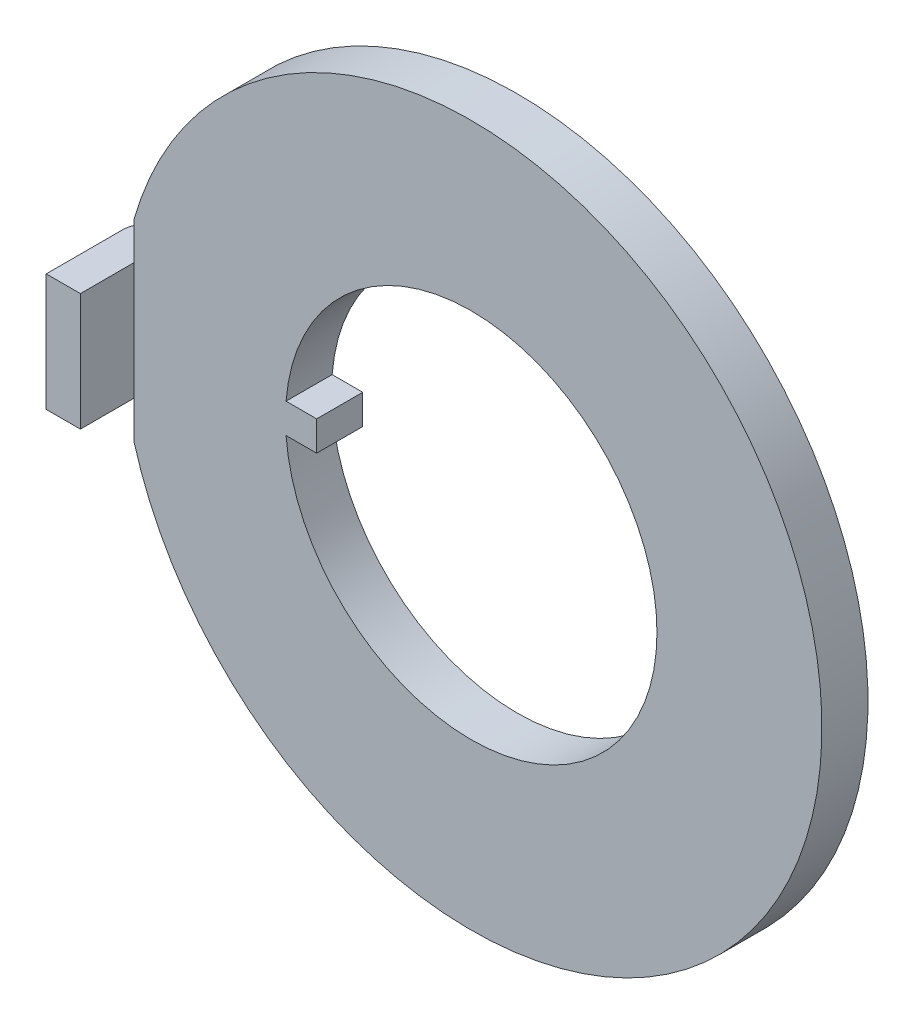
ISO-10303-21;
HEADER;
FILE_DESCRIPTION(('STEP AP214'),'2;1');
FILE_NAME('part.step','',(''),(''),'','','');
FILE_SCHEMA(('AUTOMOTIVE_DESIGN { 1 0 10303 214 1 1 1 1 }'));
ENDSEC;
DATA;
#1=APPLICATION_CONTEXT('core data for automotive mechanical design processes');
#2=APPLICATION_PROTOCOL_DEFINITION('international standard','automotive_design',2000,#1);
#3=PRODUCT_CONTEXT('',#1,'mechanical');
#4=PRODUCT('Part','Part','',(#3));
#5=PRODUCT_RELATED_PRODUCT_CATEGORY('part','',(#4));
#6=PRODUCT_DEFINITION_FORMATION('','',#4);
#7=PRODUCT_DEFINITION_CONTEXT('part definition',#1,'design');
#8=PRODUCT_DEFINITION('design','',#6,#7);
#9=PRODUCT_DEFINITION_SHAPE('','',#8);
#10=(LENGTH_UNIT() NAMED_UNIT(*) SI_UNIT(.MILLI.,.METRE.));
#11=(NAMED_UNIT(*) PLANE_ANGLE_UNIT() SI_UNIT($,.RADIAN.));
#12=(NAMED_UNIT(*) SI_UNIT($,.STERADIAN.) SOLID_ANGLE_UNIT());
#13=UNCERTAINTY_MEASURE_WITH_UNIT(LENGTH_MEASURE(1.E-05),#10,'distance_accuracy_value','');
#14=(GEOMETRIC_REPRESENTATION_CONTEXT(3) GLOBAL_UNCERTAINTY_ASSIGNED_CONTEXT((#13)) GLOBAL_UNIT_ASSIGNED_CONTEXT((#10,
#11,#12)) REPRESENTATION_CONTEXT('',''));
#15=CARTESIAN_POINT('',(0.,0.,0.));
#16=DIRECTION('',(0.,0.,1.));
#17=DIRECTION('',(1.,0.,0.));
#18=AXIS2_PLACEMENT_3D('',#15,#16,#17);
#19=CARTESIAN_POINT('',(-6.35,1.0033,1.7018));
#20=DIRECTION('',(0.,0.,-1.));
#21=DIRECTION('',(-1.,0.,0.));
#22=AXIS2_PLACEMENT_3D('',#19,#20,#21);
#23=PLANE('',#22);
#24=DIRECTION('',(0.,1.,0.));
#25=VECTOR('',#24,1.);
#26=CARTESIAN_POINT('',(-5.7658,1.0033,1.7018));
#27=LINE('',#26,#25);
#28=CARTESIAN_POINT('',(-5.7658,-1.0033,1.7018));
#29=VERTEX_POINT('',#28);
#30=CARTESIAN_POINT('',(-5.7658,1.0033,1.7018));
#31=VERTEX_POINT('',#30);
#32=EDGE_CURVE('E97',#29,#31,#27,.T.);
#33=ORIENTED_EDGE('',*,*,#32,.T.);
#34=DIRECTION('',(1.,0.,0.));
#35=VECTOR('',#34,1.);
#36=CARTESIAN_POINT('',(-5.9563,1.0033,1.7018));
#37=LINE('',#36,#35);
#38=CARTESIAN_POINT('',(-6.35,1.0033,1.7018));
#39=VERTEX_POINT('',#38);
#40=EDGE_CURVE('E85',#39,#31,#37,.T.);
#41=ORIENTED_EDGE('',*,*,#40,.F.);
#42=DIRECTION('',(0.,1.,0.));
#43=VECTOR('',#42,1.);
#44=CARTESIAN_POINT('',(-6.35,1.0033,1.7018));
#45=LINE('',#44,#43);
#46=CARTESIAN_POINT('',(-6.35,-1.0033,1.7018));
#47=VERTEX_POINT('',#46);
#48=EDGE_CURVE('E100',#39,#47,#45,.F.);
#49=ORIENTED_EDGE('',*,*,#48,.T.);
#50=DIRECTION('',(-1.,0.,0.));
#51=VECTOR('',#50,1.);
#52=CARTESIAN_POINT('',(-6.35,-1.0033,1.7018));
#53=LINE('',#52,#51);
#54=EDGE_CURVE('E95',#29,#47,#53,.T.);
#55=ORIENTED_EDGE('',*,*,#54,.F.);
#56=EDGE_LOOP('',(#33,#41,#49,#55));
#57=FACE_BOUND('',#56,.T.);
#58=ADVANCED_FACE('F17',(#57),#23,.F.);
#59=CARTESIAN_POINT('',(-5.7658,1.0033,1.7018));
#60=DIRECTION('',(-1.,0.,0.));
#61=DIRECTION('',(0.,0.,1.));
#62=AXIS2_PLACEMENT_3D('',#59,#60,#61);
#63=PLANE('',#62);
#64=DIRECTION('',(0.,1.,0.));
#65=VECTOR('',#64,1.);
#66=CARTESIAN_POINT('',(-5.7658,0.,0.7874));
#67=LINE('',#66,#65);
#68=CARTESIAN_POINT('',(-5.7658,1.0033,0.7874));
#69=VERTEX_POINT('',#68);
#70=CARTESIAN_POINT('',(-5.7658,-1.0033,0.7874));
#71=VERTEX_POINT('',#70);
#72=EDGE_CURVE('E120',#69,#71,#67,.F.);
#73=ORIENTED_EDGE('',*,*,#72,.F.);
#74=DIRECTION('',(0.,0.,1.));
#75=VECTOR('',#74,1.);
#76=CARTESIAN_POINT('',(-5.7658,1.0033,0.3937));
#77=LINE('',#76,#75);
#78=EDGE_CURVE('E111',#31,#69,#77,.F.);
#79=ORIENTED_EDGE('',*,*,#78,.F.);
#80=ORIENTED_EDGE('',*,*,#32,.F.);
#81=DIRECTION('',(0.,0.,1.));
#82=VECTOR('',#81,1.);
#83=CARTESIAN_POINT('',(-5.7658,-1.0033,0.3937));
#84=LINE('',#83,#82);
#85=EDGE_CURVE('E109',#29,#71,#84,.F.);
#86=ORIENTED_EDGE('',*,*,#85,.T.);
#87=EDGE_LOOP('',(#73,#79,#80,#86));
#88=FACE_BOUND('',#87,.T.);
#89=ADVANCED_FACE('F108',(#88),#63,.F.);
#90=CARTESIAN_POINT('',(-5.9563,1.0033,0.3937));
#91=DIRECTION('',(0.,1.,0.));
#92=DIRECTION('',(0.,0.,1.));
#93=AXIS2_PLACEMENT_3D('',#90,#91,#92);
#94=PLANE('',#93);
#95=ORIENTED_EDGE('',*,*,#40,.T.);
#96=ORIENTED_EDGE('',*,*,#78,.T.);
#97=DIRECTION('',(0.,0.,-1.));
#98=VECTOR('',#97,1.);
#99=CARTESIAN_POINT('',(-5.7658,1.0033,0.7874));
#100=LINE('',#99,#98);
#101=CARTESIAN_POINT('',(-5.7658,1.0033,0.));
#102=VERTEX_POINT('',#101);
#103=EDGE_CURVE('E158',#69,#102,#100,.T.);
#104=ORIENTED_EDGE('',*,*,#103,.T.);
#105=DIRECTION('',(1.,0.,0.));
#106=VECTOR('',#105,1.);
#107=CARTESIAN_POINT('',(-5.9563,1.0033,0.));
#108=LINE('',#107,#106);
#109=CARTESIAN_POINT('',(-5.9563,1.0033,0.));
#110=VERTEX_POINT('',#109);
#111=EDGE_CURVE('E77',#102,#110,#108,.F.);
#112=ORIENTED_EDGE('',*,*,#111,.T.);
#113=CARTESIAN_POINT('',(-5.9563,1.0033,0.3937));
#114=DIRECTION('',(0.,1.,0.));
#115=DIRECTION('',(0.,0.,1.));
#116=AXIS2_PLACEMENT_3D('',#113,#114,#115);
#117=CIRCLE('',#116,0.3937);
#118=CARTESIAN_POINT('',(-6.35,1.0033,0.3937));
#119=VERTEX_POINT('',#118);
#120=EDGE_CURVE('E20',#110,#119,#117,.T.);
#121=ORIENTED_EDGE('',*,*,#120,.T.);
#122=DIRECTION('',(0.,0.,-1.));
#123=VECTOR('',#122,1.);
#124=CARTESIAN_POINT('',(-6.35,1.0033,0.3937));
#125=LINE('',#124,#123);
#126=EDGE_CURVE('E152',#119,#39,#125,.F.);
#127=ORIENTED_EDGE('',*,*,#126,.T.);
#128=EDGE_LOOP('',(#95,#96,#104,#112,#121,#127));
#129=FACE_BOUND('',#128,.T.);
#130=ADVANCED_FACE('F275',(#129),#94,.T.);
#131=CARTESIAN_POINT('',(-6.35,1.0033,0.3937));
#132=DIRECTION('',(1.,0.,0.));
#133=DIRECTION('',(0.,0.,-1.));
#134=AXIS2_PLACEMENT_3D('',#131,#132,#133);
#135=PLANE('',#134);
#136=ORIENTED_EDGE('',*,*,#48,.F.);
#137=ORIENTED_EDGE('',*,*,#126,.F.);
#138=DIRECTION('',(0.,1.,0.));
#139=VECTOR('',#138,1.);
#140=CARTESIAN_POINT('',(-6.35,1.0033,0.3937));
#141=LINE('',#140,#139);
#142=CARTESIAN_POINT('',(-6.35,-1.0033,0.3937));
#143=VERTEX_POINT('',#142);
#144=EDGE_CURVE('E132',#143,#119,#141,.T.);
#145=ORIENTED_EDGE('',*,*,#144,.F.);
#146=DIRECTION('',(0.,0.,1.));
#147=VECTOR('',#146,1.);
#148=CARTESIAN_POINT('',(-6.35,-1.0033,0.3937));
#149=LINE('',#148,#147);
#150=EDGE_CURVE('E118',#143,#47,#149,.T.);
#151=ORIENTED_EDGE('',*,*,#150,.T.);
#152=EDGE_LOOP('',(#136,#137,#145,#151));
#153=FACE_BOUND('',#152,.T.);
#154=ADVANCED_FACE('F293',(#153),#135,.F.);
#155=CARTESIAN_POINT('',(-5.9563,-1.0033,0.3937));
#156=DIRECTION('',(0.,1.,0.));
#157=DIRECTION('',(0.,0.,1.));
#158=AXIS2_PLACEMENT_3D('',#155,#156,#157);
#159=PLANE('',#158);
#160=DIRECTION('',(0.,0.,-1.));
#161=VECTOR('',#160,1.);
#162=CARTESIAN_POINT('',(-5.7658,-1.0033,0.7874));
#163=LINE('',#162,#161);
#164=CARTESIAN_POINT('',(-5.7658,-1.0033,0.));
#165=VERTEX_POINT('',#164);
#166=EDGE_CURVE('E116',#165,#71,#163,.F.);
#167=ORIENTED_EDGE('',*,*,#166,.T.);
#168=ORIENTED_EDGE('',*,*,#85,.F.);
#169=ORIENTED_EDGE('',*,*,#54,.T.);
#170=ORIENTED_EDGE('',*,*,#150,.F.);
#171=CARTESIAN_POINT('',(-5.9563,-1.0033,0.3937));
#172=DIRECTION('',(0.,1.,0.));
#173=DIRECTION('',(0.,0.,1.));
#174=AXIS2_PLACEMENT_3D('',#171,#172,#173);
#175=CIRCLE('',#174,0.3937);
#176=CARTESIAN_POINT('',(-5.9563,-1.0033,0.));
#177=VERTEX_POINT('',#176);
#178=EDGE_CURVE('E147',#177,#143,#175,.T.);
#179=ORIENTED_EDGE('',*,*,#178,.F.);
#180=DIRECTION('',(1.,0.,0.));
#181=VECTOR('',#180,1.);
#182=CARTESIAN_POINT('',(-5.9563,-1.0033,0.));
#183=LINE('',#182,#181);
#184=EDGE_CURVE('E117',#165,#177,#183,.F.);
#185=ORIENTED_EDGE('',*,*,#184,.F.);
#186=EDGE_LOOP('',(#167,#168,#169,#170,#179,#185));
#187=FACE_BOUND('',#186,.T.);
#188=ADVANCED_FACE('F113',(#187),#159,.F.);
#189=CARTESIAN_POINT('',(0.,0.,0.7874));
#190=DIRECTION('',(0.,0.,1.));
#191=DIRECTION('',(1.,0.,0.));
#192=AXIS2_PLACEMENT_3D('',#189,#190,#191);
#193=PLANE('',#192);
#194=DIRECTION('',(1.,0.,0.));
#195=VECTOR('',#194,1.);
#196=CARTESIAN_POINT('',(-3.16482369177178,0.254,0.7874));
#197=LINE('',#196,#195);
#198=CARTESIAN_POINT('',(-3.16482369177179,0.253999999999997,0.7874));
#199=VERTEX_POINT('',#198);
#200=CARTESIAN_POINT('',(-2.6416,0.254,0.7874));
#201=VERTEX_POINT('',#200);
#202=EDGE_CURVE('E204',#199,#201,#197,.T.);
#203=ORIENTED_EDGE('',*,*,#202,.F.);
#204=CARTESIAN_POINT('',(0.,0.,0.7874));
#205=DIRECTION('',(0.,0.,1.));
#206=DIRECTION('',(1.,0.,0.));
#207=AXIS2_PLACEMENT_3D('',#204,#205,#206);
#208=CIRCLE('',#207,3.175);
#209=CARTESIAN_POINT('',(-3.16482369177179,-0.253999999999999,0.7874));
#210=VERTEX_POINT('',#209);
#211=EDGE_CURVE('E181',#199,#210,#208,.F.);
#212=ORIENTED_EDGE('',*,*,#211,.T.);
#213=DIRECTION('',(1.,0.,0.));
#214=VECTOR('',#213,1.);
#215=CARTESIAN_POINT('',(0.,-0.253999999999999,0.7874));
#216=LINE('',#215,#214);
#217=CARTESIAN_POINT('',(-2.6416,-0.254,0.7874));
#218=VERTEX_POINT('',#217);
#219=EDGE_CURVE('E137',#210,#218,#216,.T.);
#220=ORIENTED_EDGE('',*,*,#219,.T.);
#221=DIRECTION('',(0.,1.,0.));
#222=VECTOR('',#221,1.);
#223=CARTESIAN_POINT('',(-2.6416,0.254,0.7874));
#224=LINE('',#223,#222);
#225=EDGE_CURVE('E208',#201,#218,#224,.F.);
#226=ORIENTED_EDGE('',*,*,#225,.F.);
#227=EDGE_LOOP('',(#203,#212,#220,#226));
#228=FACE_BOUND('',#227,.T.);
#229=DIRECTION('',(0.,1.,0.));
#230=VECTOR('',#229,1.);
#231=CARTESIAN_POINT('',(-5.7658,1.63962853110087,0.7874));
#232=LINE('',#231,#230);
#233=CARTESIAN_POINT('',(-5.7658,-1.63962853110087,0.7874));
#234=VERTEX_POINT('',#233);
#235=EDGE_CURVE('E128',#71,#234,#232,.F.);
#236=ORIENTED_EDGE('',*,*,#235,.T.);
#237=CARTESIAN_POINT('',(0.,0.,0.7874));
#238=DIRECTION('',(0.,0.,1.));
#239=DIRECTION('',(1.,0.,0.));
#240=AXIS2_PLACEMENT_3D('',#237,#238,#239);
#241=CIRCLE('',#240,5.9944);
#242=CARTESIAN_POINT('',(-5.7658,1.63962853110087,0.7874));
#243=VERTEX_POINT('',#242);
#244=EDGE_CURVE('E187',#243,#234,#241,.F.);
#245=ORIENTED_EDGE('',*,*,#244,.F.);
#246=DIRECTION('',(0.,1.,0.));
#247=VECTOR('',#246,1.);
#248=CARTESIAN_POINT('',(-5.7658,1.63962853110087,0.7874));
#249=LINE('',#248,#247);
#250=EDGE_CURVE('E155',#243,#69,#249,.F.);
#251=ORIENTED_EDGE('',*,*,#250,.T.);
#252=ORIENTED_EDGE('',*,*,#72,.T.);
#253=EDGE_LOOP('',(#236,#245,#251,#252));
#254=FACE_BOUND('',#253,.T.);
#255=ADVANCED_FACE('F268',(#228,#254),#193,.T.);
#256=CARTESIAN_POINT('',(0.,0.,0.7874));
#257=DIRECTION('',(0.,0.,1.));
#258=DIRECTION('',(1.,0.,0.));
#259=AXIS2_PLACEMENT_3D('',#256,#257,#258);
#260=CYLINDRICAL_SURFACE('',#259,5.9944);
#261=ORIENTED_EDGE('',*,*,#244,.T.);
#262=DIRECTION('',(0.,0.,-1.));
#263=VECTOR('',#262,1.);
#264=CARTESIAN_POINT('',(-5.7658,-1.63962853110087,0.7874));
#265=LINE('',#264,#263);
#266=CARTESIAN_POINT('',(-5.7658,-1.63962853110087,0.));
#267=VERTEX_POINT('',#266);
#268=EDGE_CURVE('E131',#234,#267,#265,.T.);
#269=ORIENTED_EDGE('',*,*,#268,.T.);
#270=CARTESIAN_POINT('',(0.,0.,0.));
#271=DIRECTION('',(0.,0.,1.));
#272=DIRECTION('',(1.,0.,0.));
#273=AXIS2_PLACEMENT_3D('',#270,#271,#272);
#274=CIRCLE('',#273,5.9944);
#275=CARTESIAN_POINT('',(-5.7658,1.63962853110087,0.));
#276=VERTEX_POINT('',#275);
#277=EDGE_CURVE('E178',#267,#276,#274,.T.);
#278=ORIENTED_EDGE('',*,*,#277,.T.);
#279=DIRECTION('',(0.,0.,-1.));
#280=VECTOR('',#279,1.);
#281=CARTESIAN_POINT('',(-5.7658,1.63962853110087,0.7874));
#282=LINE('',#281,#280);
#283=EDGE_CURVE('E159',#276,#243,#282,.F.);
#284=ORIENTED_EDGE('',*,*,#283,.T.);
#285=EDGE_LOOP('',(#261,#269,#278,#284));
#286=FACE_BOUND('',#285,.T.);
#287=ADVANCED_FACE('F285',(#286),#260,.T.);
#288=CARTESIAN_POINT('',(-5.7658,1.63962853110087,0.7874));
#289=DIRECTION('',(1.,0.,0.));
#290=DIRECTION('',(0.,0.,-1.));
#291=AXIS2_PLACEMENT_3D('',#288,#289,#290);
#292=PLANE('',#291);
#293=ORIENTED_EDGE('',*,*,#103,.F.);
#294=ORIENTED_EDGE('',*,*,#250,.F.);
#295=ORIENTED_EDGE('',*,*,#283,.F.);
#296=DIRECTION('',(0.,1.,0.));
#297=VECTOR('',#296,1.);
#298=CARTESIAN_POINT('',(-5.7658,0.,0.));
#299=LINE('',#298,#297);
#300=EDGE_CURVE('E144',#276,#102,#299,.F.);
#301=ORIENTED_EDGE('',*,*,#300,.T.);
#302=EDGE_LOOP('',(#293,#294,#295,#301));
#303=FACE_BOUND('',#302,.T.);
#304=ADVANCED_FACE('F280',(#303),#292,.F.);
#305=CARTESIAN_POINT('',(-5.9563,1.0033,0.3937));
#306=DIRECTION('',(0.,1.,0.));
#307=DIRECTION('',(0.,0.,1.));
#308=AXIS2_PLACEMENT_3D('',#305,#306,#307);
#309=CYLINDRICAL_SURFACE('',#308,0.3937);
#310=ORIENTED_EDGE('',*,*,#120,.F.);
#311=DIRECTION('',(0.,1.,0.));
#312=VECTOR('',#311,1.);
#313=CARTESIAN_POINT('',(-5.9563,0.,0.));
#314=LINE('',#313,#312);
#315=EDGE_CURVE('E140',#110,#177,#314,.F.);
#316=ORIENTED_EDGE('',*,*,#315,.T.);
#317=ORIENTED_EDGE('',*,*,#178,.T.);
#318=ORIENTED_EDGE('',*,*,#144,.T.);
#319=EDGE_LOOP('',(#310,#316,#317,#318));
#320=FACE_BOUND('',#319,.T.);
#321=ADVANCED_FACE('F289',(#320),#309,.T.);
#322=CARTESIAN_POINT('',(-5.7658,1.63962853110087,0.7874));
#323=DIRECTION('',(1.,0.,0.));
#324=DIRECTION('',(0.,0.,-1.));
#325=AXIS2_PLACEMENT_3D('',#322,#323,#324);
#326=PLANE('',#325);
#327=DIRECTION('',(0.,1.,0.));
#328=VECTOR('',#327,1.);
#329=CARTESIAN_POINT('',(-5.7658,0.,0.));
#330=LINE('',#329,#328);
#331=EDGE_CURVE('E143',#165,#267,#330,.F.);
#332=ORIENTED_EDGE('',*,*,#331,.T.);
#333=ORIENTED_EDGE('',*,*,#268,.F.);
#334=ORIENTED_EDGE('',*,*,#235,.F.);
#335=ORIENTED_EDGE('',*,*,#166,.F.);
#336=EDGE_LOOP('',(#332,#333,#334,#335));
#337=FACE_BOUND('',#336,.T.);
#338=ADVANCED_FACE('F283',(#337),#326,.F.);
#339=CARTESIAN_POINT('',(-2.6416,0.254,0.7874));
#340=DIRECTION('',(1.,0.,0.));
#341=DIRECTION('',(0.,0.,-1.));
#342=AXIS2_PLACEMENT_3D('',#339,#340,#341);
#343=PLANE('',#342);
#344=ORIENTED_EDGE('',*,*,#225,.T.);
#345=DIRECTION('',(0.,0.,-1.));
#346=VECTOR('',#345,1.);
#347=CARTESIAN_POINT('',(-2.6416,-0.254,0.7874));
#348=LINE('',#347,#346);
#349=CARTESIAN_POINT('',(-2.6416,-0.253999999999999,0.));
#350=VERTEX_POINT('',#349);
#351=EDGE_CURVE('E184',#350,#218,#348,.F.);
#352=ORIENTED_EDGE('',*,*,#351,.F.);
#353=DIRECTION('',(0.,1.,0.));
#354=VECTOR('',#353,1.);
#355=CARTESIAN_POINT('',(-2.6416,0.,0.));
#356=LINE('',#355,#354);
#357=CARTESIAN_POINT('',(-2.6416,0.254,0.));
#358=VERTEX_POINT('',#357);
#359=EDGE_CURVE('E233',#350,#358,#356,.T.);
#360=ORIENTED_EDGE('',*,*,#359,.T.);
#361=DIRECTION('',(0.,0.,1.));
#362=VECTOR('',#361,1.);
#363=CARTESIAN_POINT('',(-2.6416,0.254,0.7874));
#364=LINE('',#363,#362);
#365=EDGE_CURVE('E207',#201,#358,#364,.F.);
#366=ORIENTED_EDGE('',*,*,#365,.F.);
#367=EDGE_LOOP('',(#344,#352,#360,#366));
#368=FACE_BOUND('',#367,.T.);
#369=ADVANCED_FACE('F262',(#368),#343,.T.);
#370=CARTESIAN_POINT('',(-3.16482369177178,0.254,0.7874));
#371=DIRECTION('',(0.,1.,0.));
#372=DIRECTION('',(0.,0.,1.));
#373=AXIS2_PLACEMENT_3D('',#370,#371,#372);
#374=PLANE('',#373);
#375=ORIENTED_EDGE('',*,*,#202,.T.);
#376=ORIENTED_EDGE('',*,*,#365,.T.);
#377=DIRECTION('',(1.,0.,0.));
#378=VECTOR('',#377,1.);
#379=CARTESIAN_POINT('',(0.,0.254,0.));
#380=LINE('',#379,#378);
#381=CARTESIAN_POINT('',(-3.16482369177179,0.253999999999997,0.));
#382=VERTEX_POINT('',#381);
#383=EDGE_CURVE('E177',#358,#382,#380,.F.);
#384=ORIENTED_EDGE('',*,*,#383,.T.);
#385=DIRECTION('',(0.,0.,1.));
#386=VECTOR('',#385,1.);
#387=CARTESIAN_POINT('',(-3.16482369177179,0.253999999999994,0.7874));
#388=LINE('',#387,#386);
#389=EDGE_CURVE('E185',#382,#199,#388,.T.);
#390=ORIENTED_EDGE('',*,*,#389,.T.);
#391=EDGE_LOOP('',(#375,#376,#384,#390));
#392=FACE_BOUND('',#391,.T.);
#393=ADVANCED_FACE('F254',(#392),#374,.T.);
#394=CARTESIAN_POINT('',(0.,0.,0.7874));
#395=DIRECTION('',(0.,0.,1.));
#396=DIRECTION('',(1.,0.,0.));
#397=AXIS2_PLACEMENT_3D('',#394,#395,#396);
#398=CYLINDRICAL_SURFACE('',#397,3.175);
#399=DIRECTION('',(0.,0.,-1.));
#400=VECTOR('',#399,1.);
#401=CARTESIAN_POINT('',(-3.16482369177178,-0.254,0.7874));
#402=LINE('',#401,#400);
#403=CARTESIAN_POINT('',(-3.16482369177179,-0.253999999999999,0.));
#404=VERTEX_POINT('',#403);
#405=EDGE_CURVE('E34',#210,#404,#402,.T.);
#406=ORIENTED_EDGE('',*,*,#405,.F.);
#407=ORIENTED_EDGE('',*,*,#211,.F.);
#408=ORIENTED_EDGE('',*,*,#389,.F.);
#409=CARTESIAN_POINT('',(0.,0.,0.));
#410=DIRECTION('',(0.,0.,1.));
#411=DIRECTION('',(1.,0.,0.));
#412=AXIS2_PLACEMENT_3D('',#409,#410,#411);
#413=CIRCLE('',#412,3.175);
#414=EDGE_CURVE('E26',#382,#404,#413,.F.);
#415=ORIENTED_EDGE('',*,*,#414,.T.);
#416=EDGE_LOOP('',(#406,#407,#408,#415));
#417=FACE_BOUND('',#416,.T.);
#418=ADVANCED_FACE('F266',(#417),#398,.F.);
#419=CARTESIAN_POINT('',(-2.6416,-0.254,0.7874));
#420=DIRECTION('',(0.,-1.,0.));
#421=DIRECTION('',(0.,0.,-1.));
#422=AXIS2_PLACEMENT_3D('',#419,#420,#421);
#423=PLANE('',#422);
#424=ORIENTED_EDGE('',*,*,#219,.F.);
#425=ORIENTED_EDGE('',*,*,#405,.T.);
#426=DIRECTION('',(1.,0.,0.));
#427=VECTOR('',#426,1.);
#428=CARTESIAN_POINT('',(0.,-0.253999999999999,0.));
#429=LINE('',#428,#427);
#430=EDGE_CURVE('E11',#404,#350,#429,.T.);
#431=ORIENTED_EDGE('',*,*,#430,.T.);
#432=ORIENTED_EDGE('',*,*,#351,.T.);
#433=EDGE_LOOP('',(#424,#425,#431,#432));
#434=FACE_BOUND('',#433,.T.);
#435=ADVANCED_FACE('F264',(#434),#423,.T.);
#436=CARTESIAN_POINT('',(0.,0.,0.));
#437=DIRECTION('',(0.,0.,1.));
#438=DIRECTION('',(1.,0.,0.));
#439=AXIS2_PLACEMENT_3D('',#436,#437,#438);
#440=PLANE('',#439);
#441=ORIENTED_EDGE('',*,*,#414,.F.);
#442=ORIENTED_EDGE('',*,*,#383,.F.);
#443=ORIENTED_EDGE('',*,*,#359,.F.);
#444=ORIENTED_EDGE('',*,*,#430,.F.);
#445=EDGE_LOOP('',(#441,#442,#443,#444));
#446=FACE_BOUND('',#445,.T.);
#447=ORIENTED_EDGE('',*,*,#184,.T.);
#448=ORIENTED_EDGE('',*,*,#315,.F.);
#449=ORIENTED_EDGE('',*,*,#111,.F.);
#450=ORIENTED_EDGE('',*,*,#300,.F.);
#451=ORIENTED_EDGE('',*,*,#277,.F.);
#452=ORIENTED_EDGE('',*,*,#331,.F.);
#453=EDGE_LOOP('',(#447,#448,#449,#450,#451,#452));
#454=FACE_BOUND('',#453,.T.);
#455=ADVANCED_FACE('F258',(#446,#454),#440,.F.);
#456=CLOSED_SHELL('',(#58,#89,#130,#154,#188,#255,#287,#304,#321,#338,#369,#393,#418,#435,#455));
#457=MANIFOLD_SOLID_BREP('B1',#456);
#458=ADVANCED_BREP_SHAPE_REPRESENTATION('',(#18,#457),#14);
#459=SHAPE_DEFINITION_REPRESENTATION(#9,#458);
ENDSEC;
END-ISO-10303-21;
